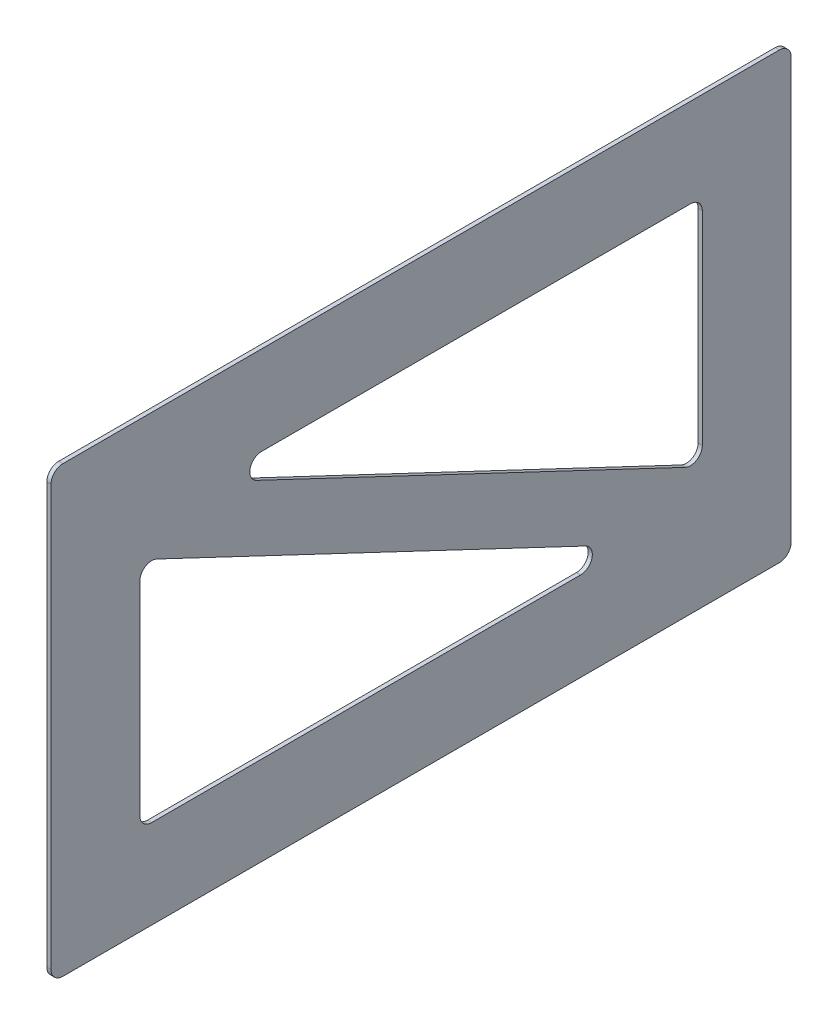
ISO-10303-21;
HEADER;
FILE_DESCRIPTION(('STEP AP214'),'2;1');
FILE_NAME('part.step','',(''),(''),'','','');
FILE_SCHEMA(('AUTOMOTIVE_DESIGN { 1 0 10303 214 1 1 1 1 }'));
ENDSEC;
DATA;
#1=APPLICATION_CONTEXT('core data for automotive mechanical design processes');
#2=APPLICATION_PROTOCOL_DEFINITION('international standard','automotive_design',2000,#1);
#3=PRODUCT_CONTEXT('',#1,'mechanical');
#4=PRODUCT('Part','Part','',(#3));
#5=PRODUCT_RELATED_PRODUCT_CATEGORY('part','',(#4));
#6=PRODUCT_DEFINITION_FORMATION('','',#4);
#7=PRODUCT_DEFINITION_CONTEXT('part definition',#1,'design');
#8=PRODUCT_DEFINITION('design','',#6,#7);
#9=PRODUCT_DEFINITION_SHAPE('','',#8);
#10=(LENGTH_UNIT() NAMED_UNIT(*) SI_UNIT(.MILLI.,.METRE.));
#11=(NAMED_UNIT(*) PLANE_ANGLE_UNIT() SI_UNIT($,.RADIAN.));
#12=(NAMED_UNIT(*) SI_UNIT($,.STERADIAN.) SOLID_ANGLE_UNIT());
#13=UNCERTAINTY_MEASURE_WITH_UNIT(LENGTH_MEASURE(1.E-05),#10,'distance_accuracy_value','');
#14=(GEOMETRIC_REPRESENTATION_CONTEXT(3) GLOBAL_UNCERTAINTY_ASSIGNED_CONTEXT((#13)) GLOBAL_UNIT_ASSIGNED_CONTEXT((#10,
#11,#12)) REPRESENTATION_CONTEXT('',''));
#15=CARTESIAN_POINT('',(0.,0.,0.));
#16=DIRECTION('',(0.,0.,1.));
#17=DIRECTION('',(1.,0.,0.));
#18=AXIS2_PLACEMENT_3D('',#15,#16,#17);
#19=CARTESIAN_POINT('',(-0.7,0.,0.));
#20=DIRECTION('',(1.,0.,0.));
#21=DIRECTION('',(0.,0.,-1.));
#22=AXIS2_PLACEMENT_3D('',#19,#20,#21);
#23=PLANE('',#22);
#24=DIRECTION('',(0.,-0.428086344739045,-0.903737838893539));
#25=VECTOR('',#24,1.);
#26=CARTESIAN_POINT('',(-0.7,4.5186891944677,-2.14043172369522));
#27=LINE('',#26,#25);
#28=CARTESIAN_POINT('',(-0.7,18.6925243222129,27.7821091015447));
#29=VERTEX_POINT('',#28);
#30=CARTESIAN_POINT('',(-0.7,-15.614498188766,-44.6438273105219));
#31=VERTEX_POINT('',#30);
#32=EDGE_CURVE('E342',#29,#31,#27,.T.);
#33=ORIENTED_EDGE('',*,*,#32,.T.);
#34=CARTESIAN_POINT('',(-0.699999999999999,-13.8070225109789,-45.5));
#35=DIRECTION('',(1.,0.,0.));
#36=DIRECTION('',(0.,0.,-1.));
#37=AXIS2_PLACEMENT_3D('',#34,#35,#36);
#38=CIRCLE('',#37,2.);
#39=CARTESIAN_POINT('',(-0.7,-13.8070225109789,-47.5));
#40=VERTEX_POINT('',#39);
#41=EDGE_CURVE('E325',#31,#40,#38,.T.);
#42=ORIENTED_EDGE('',*,*,#41,.T.);
#43=DIRECTION('',(0.,1.,0.));
#44=VECTOR('',#43,1.);
#45=CARTESIAN_POINT('',(-0.7,0.,-47.5));
#46=LINE('',#45,#44);
#47=CARTESIAN_POINT('',(-0.7,20.5,-47.5));
#48=VERTEX_POINT('',#47);
#49=EDGE_CURVE('E353',#40,#48,#46,.T.);
#50=ORIENTED_EDGE('',*,*,#49,.T.);
#51=CARTESIAN_POINT('',(-0.699999999999999,20.5,-45.5));
#52=DIRECTION('',(1.,0.,0.));
#53=DIRECTION('',(0.,0.,-1.));
#54=AXIS2_PLACEMENT_3D('',#51,#52,#53);
#55=CIRCLE('',#54,2.);
#56=CARTESIAN_POINT('',(-0.7,22.5,-45.5));
#57=VERTEX_POINT('',#56);
#58=EDGE_CURVE('E12',#48,#57,#55,.T.);
#59=ORIENTED_EDGE('',*,*,#58,.T.);
#60=DIRECTION('',(0.,0.,1.));
#61=VECTOR('',#60,1.);
#62=CARTESIAN_POINT('',(-0.7,22.5,0.));
#63=LINE('',#62,#61);
#64=CARTESIAN_POINT('',(-0.7,22.5,26.9259364120666));
#65=VERTEX_POINT('',#64);
#66=EDGE_CURVE('E351',#57,#65,#63,.T.);
#67=ORIENTED_EDGE('',*,*,#66,.T.);
#68=CARTESIAN_POINT('',(-0.699999999999999,20.5,26.9259364120666));
#69=DIRECTION('',(1.,0.,0.));
#70=DIRECTION('',(0.,0.,-1.));
#71=AXIS2_PLACEMENT_3D('',#68,#69,#70);
#72=CIRCLE('',#71,2.);
#73=EDGE_CURVE('E314',#65,#29,#72,.T.);
#74=ORIENTED_EDGE('',*,*,#73,.T.);
#75=EDGE_LOOP('',(#33,#42,#50,#59,#67,#74));
#76=FACE_BOUND('',#75,.T.);
#77=DIRECTION('',(0.,1.,0.));
#78=VECTOR('',#77,1.);
#79=CARTESIAN_POINT('',(-0.7,37.5,-62.5));
#80=LINE('',#79,#78);
#81=CARTESIAN_POINT('',(-0.7,-35.5,-62.5));
#82=VERTEX_POINT('',#81);
#83=CARTESIAN_POINT('',(-0.7,35.5,-62.5));
#84=VERTEX_POINT('',#83);
#85=EDGE_CURVE('E231',#82,#84,#80,.T.);
#86=ORIENTED_EDGE('',*,*,#85,.F.);
#87=CARTESIAN_POINT('',(-0.7,-35.5,-60.5));
#88=DIRECTION('',(1.,0.,0.));
#89=DIRECTION('',(0.,0.,-1.));
#90=AXIS2_PLACEMENT_3D('',#87,#88,#89);
#91=CIRCLE('',#90,2.);
#92=CARTESIAN_POINT('',(-0.7,-37.5,-60.5));
#93=VERTEX_POINT('',#92);
#94=EDGE_CURVE('E300',#82,#93,#91,.F.);
#95=ORIENTED_EDGE('',*,*,#94,.T.);
#96=DIRECTION('',(0.,0.,-1.));
#97=VECTOR('',#96,1.);
#98=CARTESIAN_POINT('',(-0.7,-37.5,62.5));
#99=LINE('',#98,#97);
#100=CARTESIAN_POINT('',(-0.7,-37.5,60.5));
#101=VERTEX_POINT('',#100);
#102=EDGE_CURVE('E240',#101,#93,#99,.T.);
#103=ORIENTED_EDGE('',*,*,#102,.F.);
#104=CARTESIAN_POINT('',(-0.7,-35.5,60.5));
#105=DIRECTION('',(1.,0.,0.));
#106=DIRECTION('',(0.,0.,-1.));
#107=AXIS2_PLACEMENT_3D('',#104,#105,#106);
#108=CIRCLE('',#107,2.);
#109=CARTESIAN_POINT('',(-0.7,-35.5,62.5));
#110=VERTEX_POINT('',#109);
#111=EDGE_CURVE('E298',#101,#110,#108,.F.);
#112=ORIENTED_EDGE('',*,*,#111,.T.);
#113=DIRECTION('',(0.,-1.,0.));
#114=VECTOR('',#113,1.);
#115=CARTESIAN_POINT('',(-0.7,37.5,62.5));
#116=LINE('',#115,#114);
#117=CARTESIAN_POINT('',(-0.7,35.5,62.5));
#118=VERTEX_POINT('',#117);
#119=EDGE_CURVE('E237',#118,#110,#116,.T.);
#120=ORIENTED_EDGE('',*,*,#119,.F.);
#121=CARTESIAN_POINT('',(-0.7,35.5,60.5));
#122=DIRECTION('',(1.,0.,0.));
#123=DIRECTION('',(0.,0.,-1.));
#124=AXIS2_PLACEMENT_3D('',#121,#122,#123);
#125=CIRCLE('',#124,2.);
#126=CARTESIAN_POINT('',(-0.7,37.5,60.5));
#127=VERTEX_POINT('',#126);
#128=EDGE_CURVE('E68',#118,#127,#125,.F.);
#129=ORIENTED_EDGE('',*,*,#128,.T.);
#130=DIRECTION('',(0.,0.,1.));
#131=VECTOR('',#130,1.);
#132=CARTESIAN_POINT('',(-0.7,37.5,62.5));
#133=LINE('',#132,#131);
#134=CARTESIAN_POINT('',(-0.7,37.5,-60.5));
#135=VERTEX_POINT('',#134);
#136=EDGE_CURVE('E234',#135,#127,#133,.T.);
#137=ORIENTED_EDGE('',*,*,#136,.F.);
#138=CARTESIAN_POINT('',(-0.7,35.5,-60.5));
#139=DIRECTION('',(1.,0.,0.));
#140=DIRECTION('',(0.,0.,-1.));
#141=AXIS2_PLACEMENT_3D('',#138,#139,#140);
#142=CIRCLE('',#141,2.);
#143=EDGE_CURVE('E296',#135,#84,#142,.F.);
#144=ORIENTED_EDGE('',*,*,#143,.T.);
#145=EDGE_LOOP('',(#86,#95,#103,#112,#120,#129,#137,#144));
#146=FACE_BOUND('',#145,.T.);
#147=DIRECTION('',(0.,-0.428086344739045,-0.903737838893539));
#148=VECTOR('',#147,1.);
#149=CARTESIAN_POINT('',(-0.7,-4.51868919446769,2.14043172369522));
#150=LINE('',#149,#148);
#151=CARTESIAN_POINT('',(-0.7,15.614498188766,44.6438273105219));
#152=VERTEX_POINT('',#151);
#153=CARTESIAN_POINT('',(-0.7,-18.6925243222129,-27.7821091015447));
#154=VERTEX_POINT('',#153);
#155=EDGE_CURVE('E227',#152,#154,#150,.T.);
#156=ORIENTED_EDGE('',*,*,#155,.F.);
#157=CARTESIAN_POINT('',(-0.699999999999999,13.8070225109789,45.5));
#158=DIRECTION('',(1.,0.,0.));
#159=DIRECTION('',(0.,0.,-1.));
#160=AXIS2_PLACEMENT_3D('',#157,#158,#159);
#161=CIRCLE('',#160,2.);
#162=CARTESIAN_POINT('',(-0.7,13.8070225109789,47.5));
#163=VERTEX_POINT('',#162);
#164=EDGE_CURVE('E318',#152,#163,#161,.T.);
#165=ORIENTED_EDGE('',*,*,#164,.T.);
#166=DIRECTION('',(0.,-1.,0.));
#167=VECTOR('',#166,1.);
#168=CARTESIAN_POINT('',(-0.7,0.,47.5));
#169=LINE('',#168,#167);
#170=CARTESIAN_POINT('',(-0.7,-20.5,47.5));
#171=VERTEX_POINT('',#170);
#172=EDGE_CURVE('E217',#163,#171,#169,.T.);
#173=ORIENTED_EDGE('',*,*,#172,.T.);
#174=CARTESIAN_POINT('',(-0.699999999999999,-20.5,45.5));
#175=DIRECTION('',(1.,0.,0.));
#176=DIRECTION('',(0.,0.,-1.));
#177=AXIS2_PLACEMENT_3D('',#174,#175,#176);
#178=CIRCLE('',#177,2.);
#179=CARTESIAN_POINT('',(-0.7,-22.5,45.5));
#180=VERTEX_POINT('',#179);
#181=EDGE_CURVE('E201',#171,#180,#178,.T.);
#182=ORIENTED_EDGE('',*,*,#181,.T.);
#183=DIRECTION('',(0.,0.,-1.));
#184=VECTOR('',#183,1.);
#185=CARTESIAN_POINT('',(-0.7,-22.5,0.));
#186=LINE('',#185,#184);
#187=CARTESIAN_POINT('',(-0.7,-22.5,-26.9259364120666));
#188=VERTEX_POINT('',#187);
#189=EDGE_CURVE('E210',#180,#188,#186,.T.);
#190=ORIENTED_EDGE('',*,*,#189,.T.);
#191=CARTESIAN_POINT('',(-0.699999999999999,-20.5,-26.9259364120666));
#192=DIRECTION('',(1.,0.,0.));
#193=DIRECTION('',(0.,0.,-1.));
#194=AXIS2_PLACEMENT_3D('',#191,#192,#193);
#195=CIRCLE('',#194,2.);
#196=EDGE_CURVE('E321',#188,#154,#195,.T.);
#197=ORIENTED_EDGE('',*,*,#196,.T.);
#198=EDGE_LOOP('',(#156,#165,#173,#182,#190,#197));
#199=FACE_BOUND('',#198,.T.);
#200=ADVANCED_FACE('F53',(#76,#146,#199),#23,.F.);
#201=CARTESIAN_POINT('',(0.,0.,0.));
#202=DIRECTION('',(1.,0.,0.));
#203=DIRECTION('',(0.,0.,-1.));
#204=AXIS2_PLACEMENT_3D('',#201,#202,#203);
#205=PLANE('',#204);
#206=DIRECTION('',(0.,0.,1.));
#207=VECTOR('',#206,1.);
#208=CARTESIAN_POINT('',(0.,22.5,0.));
#209=LINE('',#208,#207);
#210=CARTESIAN_POINT('',(0.,22.5,-45.5));
#211=VERTEX_POINT('',#210);
#212=CARTESIAN_POINT('',(0.,22.5,26.9259364120666));
#213=VERTEX_POINT('',#212);
#214=EDGE_CURVE('E333',#211,#213,#209,.T.);
#215=ORIENTED_EDGE('',*,*,#214,.F.);
#216=CARTESIAN_POINT('',(0.,20.5,-45.5));
#217=DIRECTION('',(1.,0.,0.));
#218=DIRECTION('',(0.,0.,-1.));
#219=AXIS2_PLACEMENT_3D('',#216,#217,#218);
#220=CIRCLE('',#219,2.);
#221=CARTESIAN_POINT('',(0.,20.5,-47.5));
#222=VERTEX_POINT('',#221);
#223=EDGE_CURVE('E61',#211,#222,#220,.F.);
#224=ORIENTED_EDGE('',*,*,#223,.T.);
#225=DIRECTION('',(0.,1.,0.));
#226=VECTOR('',#225,1.);
#227=CARTESIAN_POINT('',(0.,0.,-47.5));
#228=LINE('',#227,#226);
#229=CARTESIAN_POINT('',(0.,-13.8070225109789,-47.5));
#230=VERTEX_POINT('',#229);
#231=EDGE_CURVE('E331',#230,#222,#228,.T.);
#232=ORIENTED_EDGE('',*,*,#231,.F.);
#233=CARTESIAN_POINT('',(0.,-13.8070225109789,-45.5));
#234=DIRECTION('',(1.,0.,0.));
#235=DIRECTION('',(0.,0.,-1.));
#236=AXIS2_PLACEMENT_3D('',#233,#234,#235);
#237=CIRCLE('',#236,2.);
#238=CARTESIAN_POINT('',(0.,-15.614498188766,-44.6438273105219));
#239=VERTEX_POINT('',#238);
#240=EDGE_CURVE('E323',#230,#239,#237,.F.);
#241=ORIENTED_EDGE('',*,*,#240,.T.);
#242=DIRECTION('',(0.,-0.428086344739045,-0.903737838893539));
#243=VECTOR('',#242,1.);
#244=CARTESIAN_POINT('',(0.,4.5186891944677,-2.14043172369522));
#245=LINE('',#244,#243);
#246=CARTESIAN_POINT('',(0.,18.6925243222129,27.7821091015447));
#247=VERTEX_POINT('',#246);
#248=EDGE_CURVE('E343',#247,#239,#245,.T.);
#249=ORIENTED_EDGE('',*,*,#248,.F.);
#250=CARTESIAN_POINT('',(0.,20.5,26.9259364120666));
#251=DIRECTION('',(1.,0.,0.));
#252=DIRECTION('',(0.,0.,-1.));
#253=AXIS2_PLACEMENT_3D('',#250,#251,#252);
#254=CIRCLE('',#253,2.);
#255=EDGE_CURVE('E312',#247,#213,#254,.F.);
#256=ORIENTED_EDGE('',*,*,#255,.T.);
#257=EDGE_LOOP('',(#215,#224,#232,#241,#249,#256));
#258=FACE_BOUND('',#257,.T.);
#259=DIRECTION('',(0.,0.,-1.));
#260=VECTOR('',#259,1.);
#261=CARTESIAN_POINT('',(0.,-37.5,62.5));
#262=LINE('',#261,#260);
#263=CARTESIAN_POINT('',(0.,-37.5,60.5));
#264=VERTEX_POINT('',#263);
#265=CARTESIAN_POINT('',(0.,-37.5,-60.5));
#266=VERTEX_POINT('',#265);
#267=EDGE_CURVE('E235',#264,#266,#262,.T.);
#268=ORIENTED_EDGE('',*,*,#267,.T.);
#269=CARTESIAN_POINT('',(0.,-35.5,-60.5));
#270=DIRECTION('',(1.,0.,0.));
#271=DIRECTION('',(0.,0.,-1.));
#272=AXIS2_PLACEMENT_3D('',#269,#270,#271);
#273=CIRCLE('',#272,2.);
#274=CARTESIAN_POINT('',(0.,-35.5,-62.5));
#275=VERTEX_POINT('',#274);
#276=EDGE_CURVE('E288',#266,#275,#273,.T.);
#277=ORIENTED_EDGE('',*,*,#276,.T.);
#278=DIRECTION('',(0.,1.,0.));
#279=VECTOR('',#278,1.);
#280=CARTESIAN_POINT('',(0.,37.5,-62.5));
#281=LINE('',#280,#279);
#282=CARTESIAN_POINT('',(0.,35.5,-62.5));
#283=VERTEX_POINT('',#282);
#284=EDGE_CURVE('E230',#275,#283,#281,.T.);
#285=ORIENTED_EDGE('',*,*,#284,.T.);
#286=CARTESIAN_POINT('',(0.,35.5,-60.5));
#287=DIRECTION('',(1.,0.,0.));
#288=DIRECTION('',(0.,0.,-1.));
#289=AXIS2_PLACEMENT_3D('',#286,#287,#288);
#290=CIRCLE('',#289,2.);
#291=CARTESIAN_POINT('',(0.,37.5,-60.5));
#292=VERTEX_POINT('',#291);
#293=EDGE_CURVE('E284',#283,#292,#290,.T.);
#294=ORIENTED_EDGE('',*,*,#293,.T.);
#295=DIRECTION('',(0.,0.,1.));
#296=VECTOR('',#295,1.);
#297=CARTESIAN_POINT('',(0.,37.5,62.5));
#298=LINE('',#297,#296);
#299=CARTESIAN_POINT('',(0.,37.5,60.5));
#300=VERTEX_POINT('',#299);
#301=EDGE_CURVE('E245',#292,#300,#298,.T.);
#302=ORIENTED_EDGE('',*,*,#301,.T.);
#303=CARTESIAN_POINT('',(0.,35.5,60.5));
#304=DIRECTION('',(1.,0.,0.));
#305=DIRECTION('',(0.,0.,-1.));
#306=AXIS2_PLACEMENT_3D('',#303,#304,#305);
#307=CIRCLE('',#306,2.);
#308=CARTESIAN_POINT('',(0.,35.5,62.5));
#309=VERTEX_POINT('',#308);
#310=EDGE_CURVE('E282',#300,#309,#307,.T.);
#311=ORIENTED_EDGE('',*,*,#310,.T.);
#312=DIRECTION('',(0.,-1.,0.));
#313=VECTOR('',#312,1.);
#314=CARTESIAN_POINT('',(0.,37.5,62.5));
#315=LINE('',#314,#313);
#316=CARTESIAN_POINT('',(0.,-35.5,62.5));
#317=VERTEX_POINT('',#316);
#318=EDGE_CURVE('E248',#309,#317,#315,.T.);
#319=ORIENTED_EDGE('',*,*,#318,.T.);
#320=CARTESIAN_POINT('',(0.,-35.5,60.5));
#321=DIRECTION('',(1.,0.,0.));
#322=DIRECTION('',(0.,0.,-1.));
#323=AXIS2_PLACEMENT_3D('',#320,#321,#322);
#324=CIRCLE('',#323,2.);
#325=EDGE_CURVE('E286',#317,#264,#324,.T.);
#326=ORIENTED_EDGE('',*,*,#325,.T.);
#327=EDGE_LOOP('',(#268,#277,#285,#294,#302,#311,#319,#326));
#328=FACE_BOUND('',#327,.T.);
#329=DIRECTION('',(0.,-1.,0.));
#330=VECTOR('',#329,1.);
#331=CARTESIAN_POINT('',(0.,0.,47.5));
#332=LINE('',#331,#330);
#333=CARTESIAN_POINT('',(0.,13.8070225109789,47.5));
#334=VERTEX_POINT('',#333);
#335=CARTESIAN_POINT('',(0.,-20.5,47.5));
#336=VERTEX_POINT('',#335);
#337=EDGE_CURVE('E218',#334,#336,#332,.T.);
#338=ORIENTED_EDGE('',*,*,#337,.F.);
#339=CARTESIAN_POINT('',(0.,13.8070225109789,45.5));
#340=DIRECTION('',(1.,0.,0.));
#341=DIRECTION('',(0.,0.,-1.));
#342=AXIS2_PLACEMENT_3D('',#339,#340,#341);
#343=CIRCLE('',#342,2.);
#344=CARTESIAN_POINT('',(0.,15.614498188766,44.6438273105219));
#345=VERTEX_POINT('',#344);
#346=EDGE_CURVE('E316',#334,#345,#343,.F.);
#347=ORIENTED_EDGE('',*,*,#346,.T.);
#348=DIRECTION('',(0.,-0.428086344739045,-0.903737838893539));
#349=VECTOR('',#348,1.);
#350=CARTESIAN_POINT('',(0.,-4.51868919446769,2.14043172369522));
#351=LINE('',#350,#349);
#352=CARTESIAN_POINT('',(0.,-18.6925243222129,-27.7821091015447));
#353=VERTEX_POINT('',#352);
#354=EDGE_CURVE('E222',#345,#353,#351,.T.);
#355=ORIENTED_EDGE('',*,*,#354,.T.);
#356=CARTESIAN_POINT('',(0.,-20.5,-26.9259364120666));
#357=DIRECTION('',(1.,0.,0.));
#358=DIRECTION('',(0.,0.,-1.));
#359=AXIS2_PLACEMENT_3D('',#356,#357,#358);
#360=CIRCLE('',#359,2.);
#361=CARTESIAN_POINT('',(0.,-22.5,-26.9259364120666));
#362=VERTEX_POINT('',#361);
#363=EDGE_CURVE('E216',#353,#362,#360,.F.);
#364=ORIENTED_EDGE('',*,*,#363,.T.);
#365=DIRECTION('',(0.,0.,-1.));
#366=VECTOR('',#365,1.);
#367=CARTESIAN_POINT('',(0.,-22.5,0.));
#368=LINE('',#367,#366);
#369=CARTESIAN_POINT('',(0.,-22.5,45.5));
#370=VERTEX_POINT('',#369);
#371=EDGE_CURVE('E207',#370,#362,#368,.T.);
#372=ORIENTED_EDGE('',*,*,#371,.F.);
#373=CARTESIAN_POINT('',(0.,-20.5,45.5));
#374=DIRECTION('',(1.,0.,0.));
#375=DIRECTION('',(0.,0.,-1.));
#376=AXIS2_PLACEMENT_3D('',#373,#374,#375);
#377=CIRCLE('',#376,2.);
#378=EDGE_CURVE('E191',#370,#336,#377,.F.);
#379=ORIENTED_EDGE('',*,*,#378,.T.);
#380=EDGE_LOOP('',(#338,#347,#355,#364,#372,#379));
#381=FACE_BOUND('',#380,.T.);
#382=ADVANCED_FACE('F214',(#258,#328,#381),#205,.T.);
#383=CARTESIAN_POINT('',(-0.7,37.5,-62.5));
#384=DIRECTION('',(0.,0.,-1.));
#385=DIRECTION('',(0.,1.,0.));
#386=AXIS2_PLACEMENT_3D('',#383,#384,#385);
#387=PLANE('',#386);
#388=ORIENTED_EDGE('',*,*,#284,.F.);
#389=DIRECTION('',(1.,0.,0.));
#390=VECTOR('',#389,1.);
#391=CARTESIAN_POINT('',(-0.7,-35.5,-62.5));
#392=LINE('',#391,#390);
#393=EDGE_CURVE('E293',#275,#82,#392,.F.);
#394=ORIENTED_EDGE('',*,*,#393,.T.);
#395=ORIENTED_EDGE('',*,*,#85,.T.);
#396=DIRECTION('',(1.,0.,0.));
#397=VECTOR('',#396,1.);
#398=CARTESIAN_POINT('',(-0.7,35.5,-62.5));
#399=LINE('',#398,#397);
#400=EDGE_CURVE('E290',#84,#283,#399,.T.);
#401=ORIENTED_EDGE('',*,*,#400,.T.);
#402=EDGE_LOOP('',(#388,#394,#395,#401));
#403=FACE_BOUND('',#402,.T.);
#404=ADVANCED_FACE('F391',(#403),#387,.T.);
#405=CARTESIAN_POINT('',(-0.7,-37.5,62.5));
#406=DIRECTION('',(0.,-1.,0.));
#407=DIRECTION('',(0.,0.,-1.));
#408=AXIS2_PLACEMENT_3D('',#405,#406,#407);
#409=PLANE('',#408);
#410=ORIENTED_EDGE('',*,*,#102,.T.);
#411=DIRECTION('',(1.,0.,0.));
#412=VECTOR('',#411,1.);
#413=CARTESIAN_POINT('',(-0.7,-37.5,-60.5));
#414=LINE('',#413,#412);
#415=EDGE_CURVE('E279',#93,#266,#414,.T.);
#416=ORIENTED_EDGE('',*,*,#415,.T.);
#417=ORIENTED_EDGE('',*,*,#267,.F.);
#418=DIRECTION('',(1.,0.,0.));
#419=VECTOR('',#418,1.);
#420=CARTESIAN_POINT('',(-0.7,-37.5,60.5));
#421=LINE('',#420,#419);
#422=EDGE_CURVE('E277',#264,#101,#421,.F.);
#423=ORIENTED_EDGE('',*,*,#422,.T.);
#424=EDGE_LOOP('',(#410,#416,#417,#423));
#425=FACE_BOUND('',#424,.T.);
#426=ADVANCED_FACE('F397',(#425),#409,.T.);
#427=CARTESIAN_POINT('',(-0.7,37.5,62.5));
#428=DIRECTION('',(0.,0.,1.));
#429=DIRECTION('',(0.,-1.,0.));
#430=AXIS2_PLACEMENT_3D('',#427,#428,#429);
#431=PLANE('',#430);
#432=ORIENTED_EDGE('',*,*,#119,.T.);
#433=DIRECTION('',(1.,0.,0.));
#434=VECTOR('',#433,1.);
#435=CARTESIAN_POINT('',(-0.7,-35.5,62.5));
#436=LINE('',#435,#434);
#437=EDGE_CURVE('E304',#110,#317,#436,.T.);
#438=ORIENTED_EDGE('',*,*,#437,.T.);
#439=ORIENTED_EDGE('',*,*,#318,.F.);
#440=DIRECTION('',(1.,0.,0.));
#441=VECTOR('',#440,1.);
#442=CARTESIAN_POINT('',(-0.7,35.5,62.5));
#443=LINE('',#442,#441);
#444=EDGE_CURVE('E302',#309,#118,#443,.F.);
#445=ORIENTED_EDGE('',*,*,#444,.T.);
#446=EDGE_LOOP('',(#432,#438,#439,#445));
#447=FACE_BOUND('',#446,.T.);
#448=ADVANCED_FACE('F400',(#447),#431,.T.);
#449=CARTESIAN_POINT('',(-0.7,37.5,62.5));
#450=DIRECTION('',(0.,1.,0.));
#451=DIRECTION('',(0.,0.,1.));
#452=AXIS2_PLACEMENT_3D('',#449,#450,#451);
#453=PLANE('',#452);
#454=ORIENTED_EDGE('',*,*,#301,.F.);
#455=DIRECTION('',(1.,0.,0.));
#456=VECTOR('',#455,1.);
#457=CARTESIAN_POINT('',(-0.7,37.5,-60.5));
#458=LINE('',#457,#456);
#459=EDGE_CURVE('E75',#292,#135,#458,.F.);
#460=ORIENTED_EDGE('',*,*,#459,.T.);
#461=ORIENTED_EDGE('',*,*,#136,.T.);
#462=DIRECTION('',(1.,0.,0.));
#463=VECTOR('',#462,1.);
#464=CARTESIAN_POINT('',(-0.7,37.5,60.5));
#465=LINE('',#464,#463);
#466=EDGE_CURVE('E307',#127,#300,#465,.T.);
#467=ORIENTED_EDGE('',*,*,#466,.T.);
#468=EDGE_LOOP('',(#454,#460,#461,#467));
#469=FACE_BOUND('',#468,.T.);
#470=ADVANCED_FACE('F404',(#469),#453,.T.);
#471=CARTESIAN_POINT('',(-10.,-4.51868919446769,2.14043172369522));
#472=DIRECTION('',(0.,-0.903737838893539,0.428086344739045));
#473=DIRECTION('',(0.,-0.428086344739045,-0.903737838893539));
#474=AXIS2_PLACEMENT_3D('',#471,#472,#473);
#475=PLANE('',#474);
#476=ORIENTED_EDGE('',*,*,#354,.F.);
#477=DIRECTION('',(1.,0.,0.));
#478=VECTOR('',#477,1.);
#479=CARTESIAN_POINT('',(-10.,15.614498188766,44.6438273105219));
#480=LINE('',#479,#478);
#481=EDGE_CURVE('E270',#345,#152,#480,.F.);
#482=ORIENTED_EDGE('',*,*,#481,.T.);
#483=ORIENTED_EDGE('',*,*,#155,.T.);
#484=DIRECTION('',(1.,0.,0.));
#485=VECTOR('',#484,1.);
#486=CARTESIAN_POINT('',(-10.,-18.6925243222129,-27.7821091015447));
#487=LINE('',#486,#485);
#488=EDGE_CURVE('E267',#154,#353,#487,.T.);
#489=ORIENTED_EDGE('',*,*,#488,.T.);
#490=EDGE_LOOP('',(#476,#482,#483,#489));
#491=FACE_BOUND('',#490,.T.);
#492=ADVANCED_FACE('F394',(#491),#475,.T.);
#493=CARTESIAN_POINT('',(-10.,-22.5,0.));
#494=DIRECTION('',(0.,-1.,0.));
#495=DIRECTION('',(0.,0.,-1.));
#496=AXIS2_PLACEMENT_3D('',#493,#494,#495);
#497=PLANE('',#496);
#498=ORIENTED_EDGE('',*,*,#189,.F.);
#499=DIRECTION('',(1.,0.,0.));
#500=VECTOR('',#499,1.);
#501=CARTESIAN_POINT('',(0.,-22.5,45.5));
#502=LINE('',#501,#500);
#503=EDGE_CURVE('E195',#180,#370,#502,.T.);
#504=ORIENTED_EDGE('',*,*,#503,.T.);
#505=ORIENTED_EDGE('',*,*,#371,.T.);
#506=DIRECTION('',(1.,0.,0.));
#507=VECTOR('',#506,1.);
#508=CARTESIAN_POINT('',(-10.,-22.5,-26.9259364120666));
#509=LINE('',#508,#507);
#510=EDGE_CURVE('E212',#362,#188,#509,.F.);
#511=ORIENTED_EDGE('',*,*,#510,.T.);
#512=EDGE_LOOP('',(#498,#504,#505,#511));
#513=FACE_BOUND('',#512,.T.);
#514=ADVANCED_FACE('F206',(#513),#497,.F.);
#515=CARTESIAN_POINT('',(-10.,0.,47.5));
#516=DIRECTION('',(0.,0.,1.));
#517=DIRECTION('',(0.,-1.,0.));
#518=AXIS2_PLACEMENT_3D('',#515,#516,#517);
#519=PLANE('',#518);
#520=ORIENTED_EDGE('',*,*,#337,.T.);
#521=DIRECTION('',(1.,0.,0.));
#522=VECTOR('',#521,1.);
#523=CARTESIAN_POINT('',(-0.699999999999999,-20.5,47.5));
#524=LINE('',#523,#522);
#525=EDGE_CURVE('E196',#336,#171,#524,.F.);
#526=ORIENTED_EDGE('',*,*,#525,.T.);
#527=ORIENTED_EDGE('',*,*,#172,.F.);
#528=DIRECTION('',(1.,0.,0.));
#529=VECTOR('',#528,1.);
#530=CARTESIAN_POINT('',(-10.,13.8070225109789,47.5));
#531=LINE('',#530,#529);
#532=EDGE_CURVE('E211',#163,#334,#531,.T.);
#533=ORIENTED_EDGE('',*,*,#532,.T.);
#534=EDGE_LOOP('',(#520,#526,#527,#533));
#535=FACE_BOUND('',#534,.T.);
#536=ADVANCED_FACE('F426',(#535),#519,.F.);
#537=CARTESIAN_POINT('',(-10.,22.5,0.));
#538=DIRECTION('',(0.,1.,0.));
#539=DIRECTION('',(0.,0.,1.));
#540=AXIS2_PLACEMENT_3D('',#537,#538,#539);
#541=PLANE('',#540);
#542=ORIENTED_EDGE('',*,*,#214,.T.);
#543=DIRECTION('',(1.,0.,0.));
#544=VECTOR('',#543,1.);
#545=CARTESIAN_POINT('',(-0.699999999999999,22.5,26.9259364120666));
#546=LINE('',#545,#544);
#547=EDGE_CURVE('E265',#213,#65,#546,.F.);
#548=ORIENTED_EDGE('',*,*,#547,.T.);
#549=ORIENTED_EDGE('',*,*,#66,.F.);
#550=DIRECTION('',(1.,0.,0.));
#551=VECTOR('',#550,1.);
#552=CARTESIAN_POINT('',(0.,22.5,-45.5));
#553=LINE('',#552,#551);
#554=EDGE_CURVE('E262',#57,#211,#553,.T.);
#555=ORIENTED_EDGE('',*,*,#554,.T.);
#556=EDGE_LOOP('',(#542,#548,#549,#555));
#557=FACE_BOUND('',#556,.T.);
#558=ADVANCED_FACE('F355',(#557),#541,.F.);
#559=CARTESIAN_POINT('',(-10.,0.,-47.5));
#560=DIRECTION('',(0.,0.,-1.));
#561=DIRECTION('',(0.,1.,0.));
#562=AXIS2_PLACEMENT_3D('',#559,#560,#561);
#563=PLANE('',#562);
#564=ORIENTED_EDGE('',*,*,#49,.F.);
#565=DIRECTION('',(1.,0.,0.));
#566=VECTOR('',#565,1.);
#567=CARTESIAN_POINT('',(0.,-13.8070225109789,-47.5));
#568=LINE('',#567,#566);
#569=EDGE_CURVE('E274',#40,#230,#568,.T.);
#570=ORIENTED_EDGE('',*,*,#569,.T.);
#571=ORIENTED_EDGE('',*,*,#231,.T.);
#572=DIRECTION('',(1.,0.,0.));
#573=VECTOR('',#572,1.);
#574=CARTESIAN_POINT('',(-0.699999999999999,20.5,-47.5));
#575=LINE('',#574,#573);
#576=EDGE_CURVE('E272',#222,#48,#575,.F.);
#577=ORIENTED_EDGE('',*,*,#576,.T.);
#578=EDGE_LOOP('',(#564,#570,#571,#577));
#579=FACE_BOUND('',#578,.T.);
#580=ADVANCED_FACE('F339',(#579),#563,.F.);
#581=CARTESIAN_POINT('',(-10.,4.5186891944677,-2.14043172369522));
#582=DIRECTION('',(0.,-0.903737838893539,0.428086344739045));
#583=DIRECTION('',(0.,-0.428086344739045,-0.903737838893539));
#584=AXIS2_PLACEMENT_3D('',#581,#582,#583);
#585=PLANE('',#584);
#586=ORIENTED_EDGE('',*,*,#32,.F.);
#587=DIRECTION('',(1.,0.,0.));
#588=VECTOR('',#587,1.);
#589=CARTESIAN_POINT('',(0.,18.6925243222129,27.7821091015447));
#590=LINE('',#589,#588);
#591=EDGE_CURVE('E259',#29,#247,#590,.T.);
#592=ORIENTED_EDGE('',*,*,#591,.T.);
#593=ORIENTED_EDGE('',*,*,#248,.T.);
#594=DIRECTION('',(1.,0.,0.));
#595=VECTOR('',#594,1.);
#596=CARTESIAN_POINT('',(-0.700000000000003,-15.614498188766,-44.6438273105219));
#597=LINE('',#596,#595);
#598=EDGE_CURVE('E257',#239,#31,#597,.F.);
#599=ORIENTED_EDGE('',*,*,#598,.T.);
#600=EDGE_LOOP('',(#586,#592,#593,#599));
#601=FACE_BOUND('',#600,.T.);
#602=ADVANCED_FACE('F369',(#601),#585,.F.);
#603=CARTESIAN_POINT('',(-10.,-20.5,45.5));
#604=DIRECTION('',(-1.,0.,0.));
#605=DIRECTION('',(0.,0.,1.));
#606=AXIS2_PLACEMENT_3D('',#603,#604,#605);
#607=CYLINDRICAL_SURFACE('',#606,2.);
#608=ORIENTED_EDGE('',*,*,#181,.F.);
#609=ORIENTED_EDGE('',*,*,#525,.F.);
#610=ORIENTED_EDGE('',*,*,#378,.F.);
#611=ORIENTED_EDGE('',*,*,#503,.F.);
#612=EDGE_LOOP('',(#608,#609,#610,#611));
#613=FACE_BOUND('',#612,.T.);
#614=ADVANCED_FACE('F194',(#613),#607,.F.);
#615=CARTESIAN_POINT('',(-10.,20.5,26.9259364120666));
#616=DIRECTION('',(-1.,0.,0.));
#617=DIRECTION('',(0.,0.,1.));
#618=AXIS2_PLACEMENT_3D('',#615,#616,#617);
#619=CYLINDRICAL_SURFACE('',#618,2.);
#620=ORIENTED_EDGE('',*,*,#73,.F.);
#621=ORIENTED_EDGE('',*,*,#547,.F.);
#622=ORIENTED_EDGE('',*,*,#255,.F.);
#623=ORIENTED_EDGE('',*,*,#591,.F.);
#624=EDGE_LOOP('',(#620,#621,#622,#623));
#625=FACE_BOUND('',#624,.T.);
#626=ADVANCED_FACE('F364',(#625),#619,.F.);
#627=CARTESIAN_POINT('',(-10.,13.8070225109789,45.5));
#628=DIRECTION('',(1.,0.,0.));
#629=DIRECTION('',(0.,0.,-1.));
#630=AXIS2_PLACEMENT_3D('',#627,#628,#629);
#631=CYLINDRICAL_SURFACE('',#630,2.);
#632=ORIENTED_EDGE('',*,*,#164,.F.);
#633=ORIENTED_EDGE('',*,*,#481,.F.);
#634=ORIENTED_EDGE('',*,*,#346,.F.);
#635=ORIENTED_EDGE('',*,*,#532,.F.);
#636=EDGE_LOOP('',(#632,#633,#634,#635));
#637=FACE_BOUND('',#636,.T.);
#638=ADVANCED_FACE('F383',(#637),#631,.F.);
#639=CARTESIAN_POINT('',(-10.,-20.5,-26.9259364120666));
#640=DIRECTION('',(1.,0.,0.));
#641=DIRECTION('',(0.,0.,-1.));
#642=AXIS2_PLACEMENT_3D('',#639,#640,#641);
#643=CYLINDRICAL_SURFACE('',#642,2.);
#644=ORIENTED_EDGE('',*,*,#196,.F.);
#645=ORIENTED_EDGE('',*,*,#510,.F.);
#646=ORIENTED_EDGE('',*,*,#363,.F.);
#647=ORIENTED_EDGE('',*,*,#488,.F.);
#648=EDGE_LOOP('',(#644,#645,#646,#647));
#649=FACE_BOUND('',#648,.T.);
#650=ADVANCED_FACE('F375',(#649),#643,.F.);
#651=CARTESIAN_POINT('',(-10.,-13.8070225109789,-45.5));
#652=DIRECTION('',(-1.,0.,0.));
#653=DIRECTION('',(0.,0.,1.));
#654=AXIS2_PLACEMENT_3D('',#651,#652,#653);
#655=CYLINDRICAL_SURFACE('',#654,2.);
#656=ORIENTED_EDGE('',*,*,#41,.F.);
#657=ORIENTED_EDGE('',*,*,#598,.F.);
#658=ORIENTED_EDGE('',*,*,#240,.F.);
#659=ORIENTED_EDGE('',*,*,#569,.F.);
#660=EDGE_LOOP('',(#656,#657,#658,#659));
#661=FACE_BOUND('',#660,.T.);
#662=ADVANCED_FACE('F373',(#661),#655,.F.);
#663=CARTESIAN_POINT('',(-10.,20.5,-45.5));
#664=DIRECTION('',(-1.,0.,0.));
#665=DIRECTION('',(0.,0.,1.));
#666=AXIS2_PLACEMENT_3D('',#663,#664,#665);
#667=CYLINDRICAL_SURFACE('',#666,2.);
#668=ORIENTED_EDGE('',*,*,#58,.F.);
#669=ORIENTED_EDGE('',*,*,#576,.F.);
#670=ORIENTED_EDGE('',*,*,#223,.F.);
#671=ORIENTED_EDGE('',*,*,#554,.F.);
#672=EDGE_LOOP('',(#668,#669,#670,#671));
#673=FACE_BOUND('',#672,.T.);
#674=ADVANCED_FACE('F346',(#673),#667,.F.);
#675=CARTESIAN_POINT('',(-0.7,-35.5,-60.5));
#676=DIRECTION('',(1.,0.,0.));
#677=DIRECTION('',(0.,0.,-1.));
#678=AXIS2_PLACEMENT_3D('',#675,#676,#677);
#679=CYLINDRICAL_SURFACE('',#678,2.);
#680=ORIENTED_EDGE('',*,*,#94,.F.);
#681=ORIENTED_EDGE('',*,*,#393,.F.);
#682=ORIENTED_EDGE('',*,*,#276,.F.);
#683=ORIENTED_EDGE('',*,*,#415,.F.);
#684=EDGE_LOOP('',(#680,#681,#682,#683));
#685=FACE_BOUND('',#684,.T.);
#686=ADVANCED_FACE('F381',(#685),#679,.T.);
#687=CARTESIAN_POINT('',(-0.7,-35.5,60.5));
#688=DIRECTION('',(1.,0.,0.));
#689=DIRECTION('',(0.,0.,-1.));
#690=AXIS2_PLACEMENT_3D('',#687,#688,#689);
#691=CYLINDRICAL_SURFACE('',#690,2.);
#692=ORIENTED_EDGE('',*,*,#111,.F.);
#693=ORIENTED_EDGE('',*,*,#422,.F.);
#694=ORIENTED_EDGE('',*,*,#325,.F.);
#695=ORIENTED_EDGE('',*,*,#437,.F.);
#696=EDGE_LOOP('',(#692,#693,#694,#695));
#697=FACE_BOUND('',#696,.T.);
#698=ADVANCED_FACE('F492',(#697),#691,.T.);
#699=CARTESIAN_POINT('',(-0.7,35.5,-60.5));
#700=DIRECTION('',(1.,0.,0.));
#701=DIRECTION('',(0.,0.,-1.));
#702=AXIS2_PLACEMENT_3D('',#699,#700,#701);
#703=CYLINDRICAL_SURFACE('',#702,2.);
#704=ORIENTED_EDGE('',*,*,#143,.F.);
#705=ORIENTED_EDGE('',*,*,#459,.F.);
#706=ORIENTED_EDGE('',*,*,#293,.F.);
#707=ORIENTED_EDGE('',*,*,#400,.F.);
#708=EDGE_LOOP('',(#704,#705,#706,#707));
#709=FACE_BOUND('',#708,.T.);
#710=ADVANCED_FACE('F502',(#709),#703,.T.);
#711=CARTESIAN_POINT('',(-0.7,35.5,60.5));
#712=DIRECTION('',(1.,0.,0.));
#713=DIRECTION('',(0.,0.,-1.));
#714=AXIS2_PLACEMENT_3D('',#711,#712,#713);
#715=CYLINDRICAL_SURFACE('',#714,2.);
#716=ORIENTED_EDGE('',*,*,#128,.F.);
#717=ORIENTED_EDGE('',*,*,#444,.F.);
#718=ORIENTED_EDGE('',*,*,#310,.F.);
#719=ORIENTED_EDGE('',*,*,#466,.F.);
#720=EDGE_LOOP('',(#716,#717,#718,#719));
#721=FACE_BOUND('',#720,.T.);
#722=ADVANCED_FACE('F55',(#721),#715,.T.);
#723=CLOSED_SHELL('',(#200,#382,#404,#426,#448,#470,#492,#514,#536,#558,#580,#602,#614,#626,
#638,#650,#662,#674,#686,#698,#710,#722));
#724=MANIFOLD_SOLID_BREP('B2',#723);
#725=ADVANCED_BREP_SHAPE_REPRESENTATION('',(#18,#724),#14);
#726=SHAPE_DEFINITION_REPRESENTATION(#9,#725);
ENDSEC;
END-ISO-10303-21;
